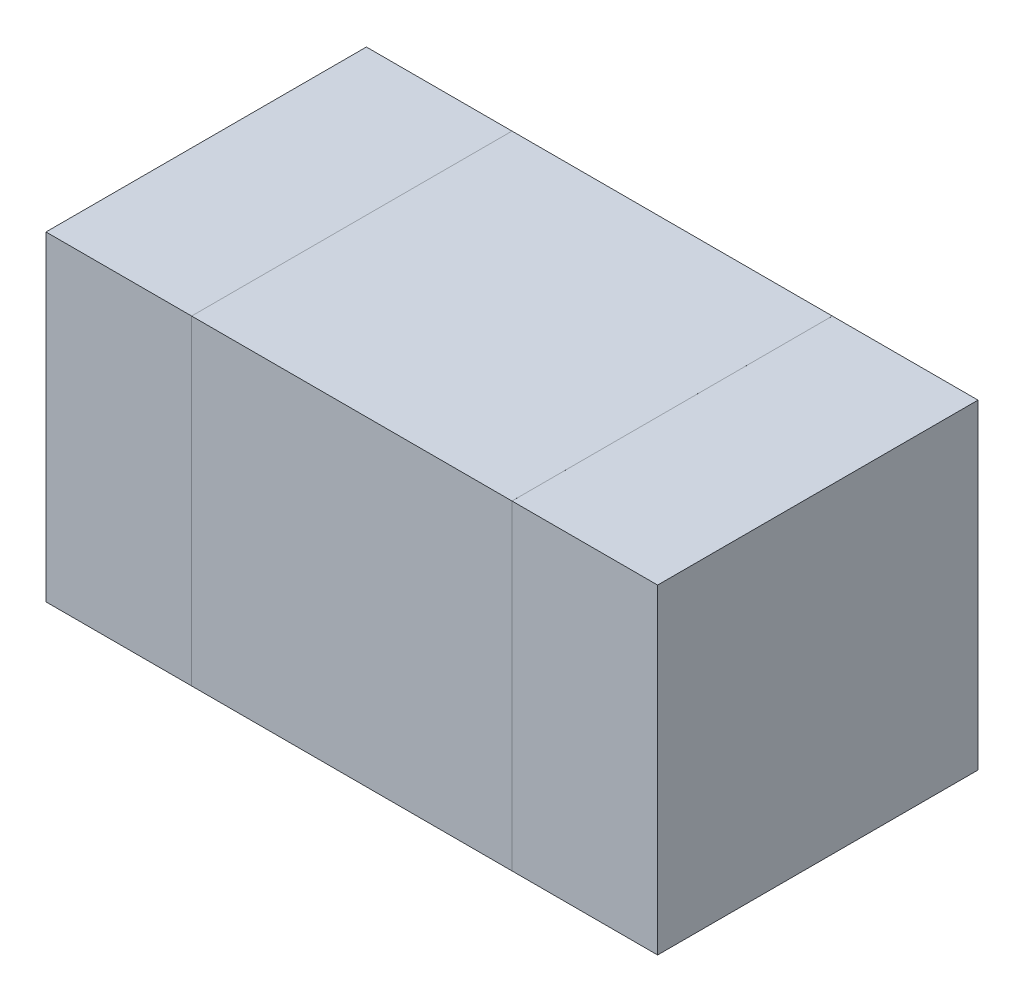
ISO-10303-21;
HEADER;
FILE_DESCRIPTION(('STEP AP214'),'2;1');
FILE_NAME('part.step','',(''),(''),'','','');
FILE_SCHEMA(('AUTOMOTIVE_DESIGN { 1 0 10303 214 1 1 1 1 }'));
ENDSEC;
DATA;
#1=APPLICATION_CONTEXT('core data for automotive mechanical design processes');
#2=APPLICATION_PROTOCOL_DEFINITION('international standard','automotive_design',2000,#1);
#3=PRODUCT_CONTEXT('',#1,'mechanical');
#4=PRODUCT('Part','Part','',(#3));
#5=PRODUCT_RELATED_PRODUCT_CATEGORY('part','',(#4));
#6=PRODUCT_DEFINITION_FORMATION('','',#4);
#7=PRODUCT_DEFINITION_CONTEXT('part definition',#1,'design');
#8=PRODUCT_DEFINITION('design','',#6,#7);
#9=PRODUCT_DEFINITION_SHAPE('','',#8);
#10=(LENGTH_UNIT() NAMED_UNIT(*) SI_UNIT(.MILLI.,.METRE.));
#11=(NAMED_UNIT(*) PLANE_ANGLE_UNIT() SI_UNIT($,.RADIAN.));
#12=(NAMED_UNIT(*) SI_UNIT($,.STERADIAN.) SOLID_ANGLE_UNIT());
#13=UNCERTAINTY_MEASURE_WITH_UNIT(LENGTH_MEASURE(1.E-05),#10,'distance_accuracy_value','');
#14=(GEOMETRIC_REPRESENTATION_CONTEXT(3) GLOBAL_UNCERTAINTY_ASSIGNED_CONTEXT((#13)) GLOBAL_UNIT_ASSIGNED_CONTEXT((#10,
#11,#12)) REPRESENTATION_CONTEXT('',''));
#15=CARTESIAN_POINT('',(0.,0.,0.));
#16=DIRECTION('',(0.,0.,1.));
#17=DIRECTION('',(1.,0.,0.));
#18=AXIS2_PLACEMENT_3D('',#15,#16,#17);
#19=CARTESIAN_POINT('',(0.984994025938,5.135001486074,0.32999934));
#20=DIRECTION('',(0.,0.,-1.));
#21=DIRECTION('',(0.,-1.,0.));
#22=AXIS2_PLACEMENT_3D('',#19,#20,#21);
#23=PLANE('',#22);
#24=DIRECTION('',(1.,0.,0.));
#25=VECTOR('',#24,1.);
#26=CARTESIAN_POINT('',(0.984994025938,5.135001486074,0.32999934));
#27=LINE('',#26,#25);
#28=CARTESIAN_POINT('',(0.984994025938,5.135001486074,0.32999934));
#29=VERTEX_POINT('',#28);
#30=CARTESIAN_POINT('',(1.314995905938,5.135001486074,0.32999934));
#31=VERTEX_POINT('',#30);
#32=EDGE_CURVE('P0_E82',#29,#31,#27,.T.);
#33=ORIENTED_EDGE('',*,*,#32,.T.);
#34=DIRECTION('',(0.,1.,0.));
#35=VECTOR('',#34,1.);
#36=CARTESIAN_POINT('',(1.314995905938,5.135001486074,0.32999934));
#37=LINE('',#36,#35);
#38=CARTESIAN_POINT('',(1.314995905938,5.465000826074,0.32999934));
#39=VERTEX_POINT('',#38);
#40=EDGE_CURVE('P0_E104',#31,#39,#37,.T.);
#41=ORIENTED_EDGE('',*,*,#40,.T.);
#42=DIRECTION('',(-1.,0.,0.));
#43=VECTOR('',#42,1.);
#44=CARTESIAN_POINT('',(1.314995905938,5.465000826074,0.32999934));
#45=LINE('',#44,#43);
#46=CARTESIAN_POINT('',(0.984994025938,5.465000826074,0.32999934));
#47=VERTEX_POINT('',#46);
#48=EDGE_CURVE('P0_E74',#39,#47,#45,.T.);
#49=ORIENTED_EDGE('',*,*,#48,.T.);
#50=DIRECTION('',(0.,-1.,0.));
#51=VECTOR('',#50,1.);
#52=CARTESIAN_POINT('',(0.984994025938,5.465000826074,0.32999934));
#53=LINE('',#52,#51);
#54=EDGE_CURVE('P0_E11',#47,#29,#53,.T.);
#55=ORIENTED_EDGE('',*,*,#54,.T.);
#56=EDGE_LOOP('',(#33,#41,#49,#55));
#57=FACE_BOUND('',#56,.T.);
#58=ADVANCED_FACE('P0_F17',(#57),#23,.F.);
#59=CARTESIAN_POINT('',(0.984994025938,5.135001486074,0.));
#60=DIRECTION('',(0.,0.,-1.));
#61=DIRECTION('',(0.,-1.,0.));
#62=AXIS2_PLACEMENT_3D('',#59,#60,#61);
#63=PLANE('',#62);
#64=DIRECTION('',(0.,-1.,0.));
#65=VECTOR('',#64,1.);
#66=CARTESIAN_POINT('',(0.984994025938,5.465000826074,0.));
#67=LINE('',#66,#65);
#68=CARTESIAN_POINT('',(0.984994025938,5.465000826074,0.));
#69=VERTEX_POINT('',#68);
#70=CARTESIAN_POINT('',(0.984994025938,5.135001486074,0.));
#71=VERTEX_POINT('',#70);
#72=EDGE_CURVE('P0_E25',#69,#71,#67,.T.);
#73=ORIENTED_EDGE('',*,*,#72,.F.);
#74=DIRECTION('',(-1.,0.,0.));
#75=VECTOR('',#74,1.);
#76=CARTESIAN_POINT('',(1.314995905938,5.465000826074,0.));
#77=LINE('',#76,#75);
#78=CARTESIAN_POINT('',(1.314995905938,5.465000826074,0.));
#79=VERTEX_POINT('',#78);
#80=EDGE_CURVE('P0_E108',#79,#69,#77,.T.);
#81=ORIENTED_EDGE('',*,*,#80,.F.);
#82=DIRECTION('',(0.,1.,0.));
#83=VECTOR('',#82,1.);
#84=CARTESIAN_POINT('',(1.314995905938,5.135001486074,0.));
#85=LINE('',#84,#83);
#86=CARTESIAN_POINT('',(1.314995905938,5.135001486074,0.));
#87=VERTEX_POINT('',#86);
#88=EDGE_CURVE('P0_E84',#87,#79,#85,.T.);
#89=ORIENTED_EDGE('',*,*,#88,.F.);
#90=DIRECTION('',(1.,0.,0.));
#91=VECTOR('',#90,1.);
#92=CARTESIAN_POINT('',(0.984994025938,5.135001486074,0.));
#93=LINE('',#92,#91);
#94=EDGE_CURVE('P0_E80',#71,#87,#93,.T.);
#95=ORIENTED_EDGE('',*,*,#94,.F.);
#96=EDGE_LOOP('',(#73,#81,#89,#95));
#97=FACE_BOUND('',#96,.T.);
#98=ADVANCED_FACE('P0_F86',(#97),#63,.T.);
#99=CARTESIAN_POINT('',(0.984994025938,5.465000826074,0.));
#100=DIRECTION('',(1.,0.,0.));
#101=DIRECTION('',(0.,1.,0.));
#102=AXIS2_PLACEMENT_3D('',#99,#100,#101);
#103=PLANE('',#102);
#104=ORIENTED_EDGE('',*,*,#72,.T.);
#105=DIRECTION('',(0.,0.,1.));
#106=VECTOR('',#105,1.);
#107=CARTESIAN_POINT('',(0.984994025938,5.135001486074,0.));
#108=LINE('',#107,#106);
#109=EDGE_CURVE('P0_E68',#71,#29,#108,.T.);
#110=ORIENTED_EDGE('',*,*,#109,.T.);
#111=ORIENTED_EDGE('',*,*,#54,.F.);
#112=DIRECTION('',(0.,0.,1.));
#113=VECTOR('',#112,1.);
#114=CARTESIAN_POINT('',(0.984994025938,5.465000826074,0.));
#115=LINE('',#114,#113);
#116=EDGE_CURVE('P0_E71',#69,#47,#115,.T.);
#117=ORIENTED_EDGE('',*,*,#116,.F.);
#118=EDGE_LOOP('',(#104,#110,#111,#117));
#119=FACE_BOUND('',#118,.T.);
#120=ADVANCED_FACE('P0_F67',(#119),#103,.F.);
#121=CARTESIAN_POINT('',(1.314995905938,5.465000826074,0.));
#122=DIRECTION('',(0.,-1.,0.));
#123=DIRECTION('',(0.,0.,-1.));
#124=AXIS2_PLACEMENT_3D('',#121,#122,#123);
#125=PLANE('',#124);
#126=ORIENTED_EDGE('',*,*,#80,.T.);
#127=ORIENTED_EDGE('',*,*,#116,.T.);
#128=ORIENTED_EDGE('',*,*,#48,.F.);
#129=DIRECTION('',(0.,0.,1.));
#130=VECTOR('',#129,1.);
#131=CARTESIAN_POINT('',(1.314995905938,5.465000826074,0.));
#132=LINE('',#131,#130);
#133=EDGE_CURVE('P0_E100',#79,#39,#132,.T.);
#134=ORIENTED_EDGE('',*,*,#133,.F.);
#135=EDGE_LOOP('',(#126,#127,#128,#134));
#136=FACE_BOUND('',#135,.T.);
#137=ADVANCED_FACE('P0_F117',(#136),#125,.F.);
#138=CARTESIAN_POINT('',(1.314995905938,5.135001486074,0.));
#139=DIRECTION('',(-1.,0.,0.));
#140=DIRECTION('',(0.,0.,1.));
#141=AXIS2_PLACEMENT_3D('',#138,#139,#140);
#142=PLANE('',#141);
#143=ORIENTED_EDGE('',*,*,#88,.T.);
#144=ORIENTED_EDGE('',*,*,#133,.T.);
#145=ORIENTED_EDGE('',*,*,#40,.F.);
#146=DIRECTION('',(0.,0.,1.));
#147=VECTOR('',#146,1.);
#148=CARTESIAN_POINT('',(1.314995905938,5.135001486074,0.));
#149=LINE('',#148,#147);
#150=EDGE_CURVE('P0_E90',#87,#31,#149,.T.);
#151=ORIENTED_EDGE('',*,*,#150,.F.);
#152=EDGE_LOOP('',(#143,#144,#145,#151));
#153=FACE_BOUND('',#152,.T.);
#154=ADVANCED_FACE('P0_F119',(#153),#142,.F.);
#155=CARTESIAN_POINT('',(0.984994025938,5.135001486074,0.));
#156=DIRECTION('',(0.,1.,0.));
#157=DIRECTION('',(1.,0.,0.));
#158=AXIS2_PLACEMENT_3D('',#155,#156,#157);
#159=PLANE('',#158);
#160=ORIENTED_EDGE('',*,*,#94,.T.);
#161=ORIENTED_EDGE('',*,*,#150,.T.);
#162=ORIENTED_EDGE('',*,*,#32,.F.);
#163=ORIENTED_EDGE('',*,*,#109,.F.);
#164=EDGE_LOOP('',(#160,#161,#162,#163));
#165=FACE_BOUND('',#164,.T.);
#166=ADVANCED_FACE('P0_F78',(#165),#159,.F.);
#167=CLOSED_SHELL('',(#58,#98,#120,#137,#154,#166));
#168=MANIFOLD_SOLID_BREP('P0_B1',#167);
#169=CARTESIAN_POINT('',(1.465001579102,5.134998946074,0.32999934));
#170=DIRECTION('',(0.,0.,-1.));
#171=DIRECTION('',(0.,-1.,0.));
#172=AXIS2_PLACEMENT_3D('',#169,#170,#171);
#173=PLANE('',#172);
#174=DIRECTION('',(0.,1.,0.));
#175=VECTOR('',#174,1.);
#176=CARTESIAN_POINT('',(1.465001579102,5.134998946074,0.32999934));
#177=LINE('',#176,#175);
#178=CARTESIAN_POINT('',(1.465001579102,5.134998946074,0.32999934));
#179=VERTEX_POINT('',#178);
#180=CARTESIAN_POINT('',(1.465001579102,5.465000826074,0.32999934));
#181=VERTEX_POINT('',#180);
#182=EDGE_CURVE('P1_E81',#179,#181,#177,.T.);
#183=ORIENTED_EDGE('',*,*,#182,.T.);
#184=DIRECTION('',(-1.,0.,0.));
#185=VECTOR('',#184,1.);
#186=CARTESIAN_POINT('',(1.465001579102,5.465000826074,0.32999934));
#187=LINE('',#186,#185);
#188=CARTESIAN_POINT('',(1.314999339102,5.465000826074,0.32999934));
#189=VERTEX_POINT('',#188);
#190=EDGE_CURVE('P1_E97',#181,#189,#187,.T.);
#191=ORIENTED_EDGE('',*,*,#190,.T.);
#192=DIRECTION('',(0.,-1.,0.));
#193=VECTOR('',#192,1.);
#194=CARTESIAN_POINT('',(1.314999339102,5.465000826074,0.32999934));
#195=LINE('',#194,#193);
#196=CARTESIAN_POINT('',(1.314999339102,5.134998946074,0.32999934));
#197=VERTEX_POINT('',#196);
#198=EDGE_CURVE('P1_E73',#189,#197,#195,.T.);
#199=ORIENTED_EDGE('',*,*,#198,.T.);
#200=DIRECTION('',(1.,0.,0.));
#201=VECTOR('',#200,1.);
#202=CARTESIAN_POINT('',(1.314999339102,5.134998946074,0.32999934));
#203=LINE('',#202,#201);
#204=EDGE_CURVE('P1_E11',#197,#179,#203,.T.);
#205=ORIENTED_EDGE('',*,*,#204,.T.);
#206=EDGE_LOOP('',(#183,#191,#199,#205));
#207=FACE_BOUND('',#206,.T.);
#208=ADVANCED_FACE('P1_F17',(#207),#173,.F.);
#209=CARTESIAN_POINT('',(1.465001579102,5.134998946074,0.));
#210=DIRECTION('',(0.,0.,-1.));
#211=DIRECTION('',(0.,-1.,0.));
#212=AXIS2_PLACEMENT_3D('',#209,#210,#211);
#213=PLANE('',#212);
#214=DIRECTION('',(1.,0.,0.));
#215=VECTOR('',#214,1.);
#216=CARTESIAN_POINT('',(1.314999339102,5.134998946074,0.));
#217=LINE('',#216,#215);
#218=CARTESIAN_POINT('',(1.314999339102,5.134998946074,0.));
#219=VERTEX_POINT('',#218);
#220=CARTESIAN_POINT('',(1.465001579102,5.134998946074,0.));
#221=VERTEX_POINT('',#220);
#222=EDGE_CURVE('P1_E27',#219,#221,#217,.T.);
#223=ORIENTED_EDGE('',*,*,#222,.F.);
#224=DIRECTION('',(0.,-1.,0.));
#225=VECTOR('',#224,1.);
#226=CARTESIAN_POINT('',(1.314999339102,5.465000826074,0.));
#227=LINE('',#226,#225);
#228=CARTESIAN_POINT('',(1.314999339102,5.465000826074,0.));
#229=VERTEX_POINT('',#228);
#230=EDGE_CURVE('P1_E94',#229,#219,#227,.T.);
#231=ORIENTED_EDGE('',*,*,#230,.F.);
#232=DIRECTION('',(-1.,0.,0.));
#233=VECTOR('',#232,1.);
#234=CARTESIAN_POINT('',(1.465001579102,5.465000826074,0.));
#235=LINE('',#234,#233);
#236=CARTESIAN_POINT('',(1.465001579102,5.465000826074,0.));
#237=VERTEX_POINT('',#236);
#238=EDGE_CURVE('P1_E83',#237,#229,#235,.T.);
#239=ORIENTED_EDGE('',*,*,#238,.F.);
#240=DIRECTION('',(0.,1.,0.));
#241=VECTOR('',#240,1.);
#242=CARTESIAN_POINT('',(1.465001579102,5.134998946074,0.));
#243=LINE('',#242,#241);
#244=EDGE_CURVE('P1_E79',#221,#237,#243,.T.);
#245=ORIENTED_EDGE('',*,*,#244,.F.);
#246=EDGE_LOOP('',(#223,#231,#239,#245));
#247=FACE_BOUND('',#246,.T.);
#248=ADVANCED_FACE('P1_F19',(#247),#213,.T.);
#249=CARTESIAN_POINT('',(1.314999339102,5.134998946074,0.));
#250=DIRECTION('',(0.,1.,0.));
#251=DIRECTION('',(1.,0.,0.));
#252=AXIS2_PLACEMENT_3D('',#249,#250,#251);
#253=PLANE('',#252);
#254=ORIENTED_EDGE('',*,*,#222,.T.);
#255=DIRECTION('',(0.,0.,1.));
#256=VECTOR('',#255,1.);
#257=CARTESIAN_POINT('',(1.465001579102,5.134998946074,0.));
#258=LINE('',#257,#256);
#259=EDGE_CURVE('P1_E65',#221,#179,#258,.T.);
#260=ORIENTED_EDGE('',*,*,#259,.T.);
#261=ORIENTED_EDGE('',*,*,#204,.F.);
#262=DIRECTION('',(0.,0.,1.));
#263=VECTOR('',#262,1.);
#264=CARTESIAN_POINT('',(1.314999339102,5.134998946074,0.));
#265=LINE('',#264,#263);
#266=EDGE_CURVE('P1_E68',#219,#197,#265,.T.);
#267=ORIENTED_EDGE('',*,*,#266,.F.);
#268=EDGE_LOOP('',(#254,#260,#261,#267));
#269=FACE_BOUND('',#268,.T.);
#270=ADVANCED_FACE('P1_F64',(#269),#253,.F.);
#271=CARTESIAN_POINT('',(1.314999339102,5.465000826074,0.));
#272=DIRECTION('',(1.,0.,0.));
#273=DIRECTION('',(0.,1.,0.));
#274=AXIS2_PLACEMENT_3D('',#271,#272,#273);
#275=PLANE('',#274);
#276=ORIENTED_EDGE('',*,*,#230,.T.);
#277=ORIENTED_EDGE('',*,*,#266,.T.);
#278=ORIENTED_EDGE('',*,*,#198,.F.);
#279=DIRECTION('',(0.,0.,1.));
#280=VECTOR('',#279,1.);
#281=CARTESIAN_POINT('',(1.314999339102,5.465000826074,0.));
#282=LINE('',#281,#280);
#283=EDGE_CURVE('P1_E102',#229,#189,#282,.T.);
#284=ORIENTED_EDGE('',*,*,#283,.F.);
#285=EDGE_LOOP('',(#276,#277,#278,#284));
#286=FACE_BOUND('',#285,.T.);
#287=ADVANCED_FACE('P1_F115',(#286),#275,.F.);
#288=CARTESIAN_POINT('',(1.465001579102,5.465000826074,0.));
#289=DIRECTION('',(0.,-1.,0.));
#290=DIRECTION('',(0.,0.,-1.));
#291=AXIS2_PLACEMENT_3D('',#288,#289,#290);
#292=PLANE('',#291);
#293=ORIENTED_EDGE('',*,*,#238,.T.);
#294=ORIENTED_EDGE('',*,*,#283,.T.);
#295=ORIENTED_EDGE('',*,*,#190,.F.);
#296=DIRECTION('',(0.,0.,1.));
#297=VECTOR('',#296,1.);
#298=CARTESIAN_POINT('',(1.465001579102,5.465000826074,0.));
#299=LINE('',#298,#297);
#300=EDGE_CURVE('P1_E88',#237,#181,#299,.T.);
#301=ORIENTED_EDGE('',*,*,#300,.F.);
#302=EDGE_LOOP('',(#293,#294,#295,#301));
#303=FACE_BOUND('',#302,.T.);
#304=ADVANCED_FACE('P1_F117',(#303),#292,.F.);
#305=CARTESIAN_POINT('',(1.465001579102,5.134998946074,0.));
#306=DIRECTION('',(-1.,0.,0.));
#307=DIRECTION('',(0.,0.,1.));
#308=AXIS2_PLACEMENT_3D('',#305,#306,#307);
#309=PLANE('',#308);
#310=ORIENTED_EDGE('',*,*,#244,.T.);
#311=ORIENTED_EDGE('',*,*,#300,.T.);
#312=ORIENTED_EDGE('',*,*,#182,.F.);
#313=ORIENTED_EDGE('',*,*,#259,.F.);
#314=EDGE_LOOP('',(#310,#311,#312,#313));
#315=FACE_BOUND('',#314,.T.);
#316=ADVANCED_FACE('P1_F77',(#315),#309,.F.);
#317=CLOSED_SHELL('',(#208,#248,#270,#287,#304,#316));
#318=MANIFOLD_SOLID_BREP('P1_B1',#317);
#319=CARTESIAN_POINT('',(0.985005851563,5.134998946074,0.32999934));
#320=DIRECTION('',(0.,0.,-1.));
#321=DIRECTION('',(0.,-1.,0.));
#322=AXIS2_PLACEMENT_3D('',#319,#320,#321);
#323=PLANE('',#322);
#324=DIRECTION('',(0.,1.,0.));
#325=VECTOR('',#324,1.);
#326=CARTESIAN_POINT('',(0.985005851563,5.134998946074,0.32999934));
#327=LINE('',#326,#325);
#328=CARTESIAN_POINT('',(0.985005851563,5.134998946074,0.32999934));
#329=VERTEX_POINT('',#328);
#330=CARTESIAN_POINT('',(0.985005851563,5.465000826074,0.32999934));
#331=VERTEX_POINT('',#330);
#332=EDGE_CURVE('P2_E71',#329,#331,#327,.T.);
#333=ORIENTED_EDGE('',*,*,#332,.T.);
#334=DIRECTION('',(-1.,0.,0.));
#335=VECTOR('',#334,1.);
#336=CARTESIAN_POINT('',(0.985005851563,5.465000826074,0.32999934));
#337=LINE('',#336,#335);
#338=CARTESIAN_POINT('',(0.835003611563,5.465000826074,0.32999934));
#339=VERTEX_POINT('',#338);
#340=EDGE_CURVE('P2_E69',#331,#339,#337,.T.);
#341=ORIENTED_EDGE('',*,*,#340,.T.);
#342=DIRECTION('',(0.,-1.,0.));
#343=VECTOR('',#342,1.);
#344=CARTESIAN_POINT('',(0.835003611563,5.465000826074,0.32999934));
#345=LINE('',#344,#343);
#346=CARTESIAN_POINT('',(0.835003611563,5.134998946074,0.32999934));
#347=VERTEX_POINT('',#346);
#348=EDGE_CURVE('P2_E56',#339,#347,#345,.T.);
#349=ORIENTED_EDGE('',*,*,#348,.T.);
#350=DIRECTION('',(1.,0.,0.));
#351=VECTOR('',#350,1.);
#352=CARTESIAN_POINT('',(0.835003611563,5.134998946074,0.32999934));
#353=LINE('',#352,#351);
#354=EDGE_CURVE('P2_E11',#347,#329,#353,.T.);
#355=ORIENTED_EDGE('',*,*,#354,.T.);
#356=EDGE_LOOP('',(#333,#341,#349,#355));
#357=FACE_BOUND('',#356,.T.);
#358=ADVANCED_FACE('P2_F17',(#357),#323,.F.);
#359=CARTESIAN_POINT('',(0.985005851563,5.134998946074,0.));
#360=DIRECTION('',(0.,0.,-1.));
#361=DIRECTION('',(0.,-1.,0.));
#362=AXIS2_PLACEMENT_3D('',#359,#360,#361);
#363=PLANE('',#362);
#364=DIRECTION('',(1.,0.,0.));
#365=VECTOR('',#364,1.);
#366=CARTESIAN_POINT('',(0.835003611563,5.134998946074,0.));
#367=LINE('',#366,#365);
#368=CARTESIAN_POINT('',(0.835003611563,5.134998946074,0.));
#369=VERTEX_POINT('',#368);
#370=CARTESIAN_POINT('',(0.985005851563,5.134998946074,0.));
#371=VERTEX_POINT('',#370);
#372=EDGE_CURVE('P2_E26',#369,#371,#367,.T.);
#373=ORIENTED_EDGE('',*,*,#372,.F.);
#374=DIRECTION('',(0.,-1.,0.));
#375=VECTOR('',#374,1.);
#376=CARTESIAN_POINT('',(0.835003611563,5.465000826074,0.));
#377=LINE('',#376,#375);
#378=CARTESIAN_POINT('',(0.835003611563,5.465000826074,0.));
#379=VERTEX_POINT('',#378);
#380=EDGE_CURVE('P2_E76',#379,#369,#377,.T.);
#381=ORIENTED_EDGE('',*,*,#380,.F.);
#382=DIRECTION('',(-1.,0.,0.));
#383=VECTOR('',#382,1.);
#384=CARTESIAN_POINT('',(0.985005851563,5.465000826074,0.));
#385=LINE('',#384,#383);
#386=CARTESIAN_POINT('',(0.985005851563,5.465000826074,0.));
#387=VERTEX_POINT('',#386);
#388=EDGE_CURVE('P2_E80',#387,#379,#385,.T.);
#389=ORIENTED_EDGE('',*,*,#388,.F.);
#390=DIRECTION('',(0.,1.,0.));
#391=VECTOR('',#390,1.);
#392=CARTESIAN_POINT('',(0.985005851563,5.134998946074,0.));
#393=LINE('',#392,#391);
#394=EDGE_CURVE('P2_E99',#371,#387,#393,.T.);
#395=ORIENTED_EDGE('',*,*,#394,.F.);
#396=EDGE_LOOP('',(#373,#381,#389,#395));
#397=FACE_BOUND('',#396,.T.);
#398=ADVANCED_FACE('P2_F124',(#397),#363,.T.);
#399=CARTESIAN_POINT('',(0.835003611563,5.134998946074,0.));
#400=DIRECTION('',(0.,1.,0.));
#401=DIRECTION('',(1.,0.,0.));
#402=AXIS2_PLACEMENT_3D('',#399,#400,#401);
#403=PLANE('',#402);
#404=ORIENTED_EDGE('',*,*,#372,.T.);
#405=DIRECTION('',(0.,0.,1.));
#406=VECTOR('',#405,1.);
#407=CARTESIAN_POINT('',(0.985005851563,5.134998946074,0.));
#408=LINE('',#407,#406);
#409=EDGE_CURVE('P2_E85',#371,#329,#408,.T.);
#410=ORIENTED_EDGE('',*,*,#409,.T.);
#411=ORIENTED_EDGE('',*,*,#354,.F.);
#412=DIRECTION('',(0.,0.,1.));
#413=VECTOR('',#412,1.);
#414=CARTESIAN_POINT('',(0.835003611563,5.134998946074,0.));
#415=LINE('',#414,#413);
#416=EDGE_CURVE('P2_E63',#369,#347,#415,.T.);
#417=ORIENTED_EDGE('',*,*,#416,.F.);
#418=EDGE_LOOP('',(#404,#410,#411,#417));
#419=FACE_BOUND('',#418,.T.);
#420=ADVANCED_FACE('P2_F104',(#419),#403,.F.);
#421=CARTESIAN_POINT('',(0.835003611563,5.465000826074,0.));
#422=DIRECTION('',(1.,0.,0.));
#423=DIRECTION('',(0.,1.,0.));
#424=AXIS2_PLACEMENT_3D('',#421,#422,#423);
#425=PLANE('',#424);
#426=ORIENTED_EDGE('',*,*,#380,.T.);
#427=ORIENTED_EDGE('',*,*,#416,.T.);
#428=ORIENTED_EDGE('',*,*,#348,.F.);
#429=DIRECTION('',(0.,0.,1.));
#430=VECTOR('',#429,1.);
#431=CARTESIAN_POINT('',(0.835003611563,5.465000826074,0.));
#432=LINE('',#431,#430);
#433=EDGE_CURVE('P2_E61',#379,#339,#432,.T.);
#434=ORIENTED_EDGE('',*,*,#433,.F.);
#435=EDGE_LOOP('',(#426,#427,#428,#434));
#436=FACE_BOUND('',#435,.T.);
#437=ADVANCED_FACE('P2_F59',(#436),#425,.F.);
#438=CARTESIAN_POINT('',(0.985005851563,5.465000826074,0.));
#439=DIRECTION('',(0.,-1.,0.));
#440=DIRECTION('',(0.,0.,-1.));
#441=AXIS2_PLACEMENT_3D('',#438,#439,#440);
#442=PLANE('',#441);
#443=ORIENTED_EDGE('',*,*,#388,.T.);
#444=ORIENTED_EDGE('',*,*,#433,.T.);
#445=ORIENTED_EDGE('',*,*,#340,.F.);
#446=DIRECTION('',(0.,0.,1.));
#447=VECTOR('',#446,1.);
#448=CARTESIAN_POINT('',(0.985005851563,5.465000826074,0.));
#449=LINE('',#448,#447);
#450=EDGE_CURVE('P2_E97',#387,#331,#449,.T.);
#451=ORIENTED_EDGE('',*,*,#450,.F.);
#452=EDGE_LOOP('',(#443,#444,#445,#451));
#453=FACE_BOUND('',#452,.T.);
#454=ADVANCED_FACE('P2_F78',(#453),#442,.F.);
#455=CARTESIAN_POINT('',(0.985005851563,5.134998946074,0.));
#456=DIRECTION('',(-1.,0.,0.));
#457=DIRECTION('',(0.,0.,1.));
#458=AXIS2_PLACEMENT_3D('',#455,#456,#457);
#459=PLANE('',#458);
#460=ORIENTED_EDGE('',*,*,#394,.T.);
#461=ORIENTED_EDGE('',*,*,#450,.T.);
#462=ORIENTED_EDGE('',*,*,#332,.F.);
#463=ORIENTED_EDGE('',*,*,#409,.F.);
#464=EDGE_LOOP('',(#460,#461,#462,#463));
#465=FACE_BOUND('',#464,.T.);
#466=ADVANCED_FACE('P2_F109',(#465),#459,.F.);
#467=CLOSED_SHELL('',(#358,#398,#420,#437,#454,#466));
#468=MANIFOLD_SOLID_BREP('P2_B1',#467);
#469=ADVANCED_BREP_SHAPE_REPRESENTATION('',(#18,#168,#318,#468),#14);
#470=SHAPE_DEFINITION_REPRESENTATION(#9,#469);
ENDSEC;
END-ISO-10303-21;
